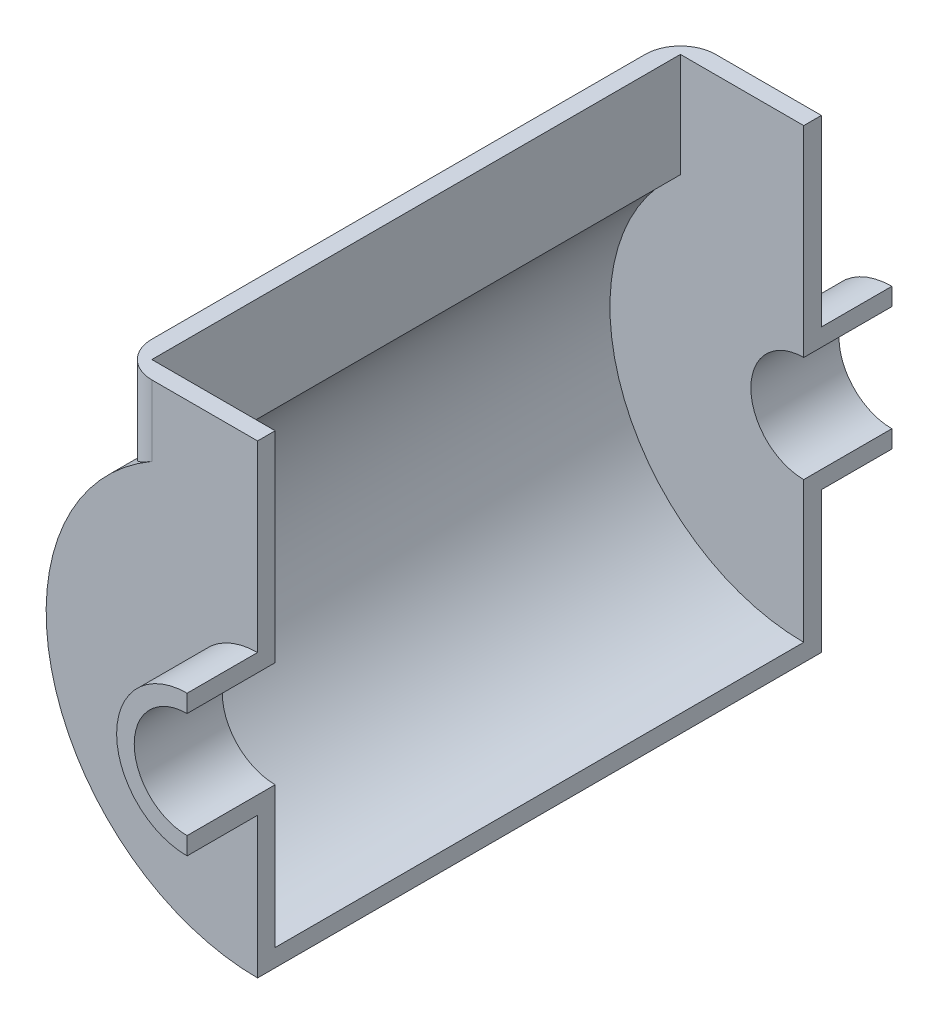
ISO-10303-21;
HEADER;
FILE_DESCRIPTION(('STEP AP214'),'2;1');
FILE_NAME('part.step','',(''),(''),'','','');
FILE_SCHEMA(('AUTOMOTIVE_DESIGN { 1 0 10303 214 1 1 1 1 }'));
ENDSEC;
DATA;
#1=APPLICATION_CONTEXT('core data for automotive mechanical design processes');
#2=APPLICATION_PROTOCOL_DEFINITION('international standard','automotive_design',2000,#1);
#3=PRODUCT_CONTEXT('',#1,'mechanical');
#4=PRODUCT('Part','Part','',(#3));
#5=PRODUCT_RELATED_PRODUCT_CATEGORY('part','',(#4));
#6=PRODUCT_DEFINITION_FORMATION('','',#4);
#7=PRODUCT_DEFINITION_CONTEXT('part definition',#1,'design');
#8=PRODUCT_DEFINITION('design','',#6,#7);
#9=PRODUCT_DEFINITION_SHAPE('','',#8);
#10=(LENGTH_UNIT() NAMED_UNIT(*) SI_UNIT(.MILLI.,.METRE.));
#11=(NAMED_UNIT(*) PLANE_ANGLE_UNIT() SI_UNIT($,.RADIAN.));
#12=(NAMED_UNIT(*) SI_UNIT($,.STERADIAN.) SOLID_ANGLE_UNIT());
#13=UNCERTAINTY_MEASURE_WITH_UNIT(LENGTH_MEASURE(1.E-05),#10,'distance_accuracy_value','');
#14=(GEOMETRIC_REPRESENTATION_CONTEXT(3) GLOBAL_UNCERTAINTY_ASSIGNED_CONTEXT((#13)) GLOBAL_UNIT_ASSIGNED_CONTEXT((#10,
#11,#12)) REPRESENTATION_CONTEXT('',''));
#15=CARTESIAN_POINT('',(0.,0.,0.));
#16=DIRECTION('',(0.,0.,1.));
#17=DIRECTION('',(1.,0.,0.));
#18=AXIS2_PLACEMENT_3D('',#15,#16,#17);
#19=CARTESIAN_POINT('',(0.,0.,25.));
#20=DIRECTION('',(0.,0.,-1.));
#21=DIRECTION('',(-1.,0.,0.));
#22=AXIS2_PLACEMENT_3D('',#19,#20,#21);
#23=CYLINDRICAL_SURFACE('',#22,15.);
#24=CARTESIAN_POINT('',(0.,0.,0.));
#25=DIRECTION('',(0.,0.,-1.));
#26=DIRECTION('',(-1.,0.,0.));
#27=AXIS2_PLACEMENT_3D('',#24,#25,#26);
#28=CIRCLE('',#27,15.);
#29=CARTESIAN_POINT('',(0.,-15.,0.));
#30=VERTEX_POINT('',#29);
#31=CARTESIAN_POINT('',(0.,15.,0.));
#32=VERTEX_POINT('',#31);
#33=EDGE_CURVE('E267',#30,#32,#28,.T.);
#34=ORIENTED_EDGE('',*,*,#33,.T.);
#35=DIRECTION('',(0.,0.,-1.));
#36=VECTOR('',#35,1.);
#37=CARTESIAN_POINT('',(0.,15.,25.));
#38=LINE('',#37,#36);
#39=CARTESIAN_POINT('',(0.,15.,25.));
#40=VERTEX_POINT('',#39);
#41=EDGE_CURVE('E291',#40,#32,#38,.T.);
#42=ORIENTED_EDGE('',*,*,#41,.F.);
#43=CARTESIAN_POINT('',(0.,0.,25.));
#44=DIRECTION('',(0.,0.,-1.));
#45=DIRECTION('',(-1.,0.,0.));
#46=AXIS2_PLACEMENT_3D('',#43,#44,#45);
#47=CIRCLE('',#46,15.);
#48=CARTESIAN_POINT('',(0.,-15.,25.));
#49=VERTEX_POINT('',#48);
#50=EDGE_CURVE('E268',#49,#40,#47,.T.);
#51=ORIENTED_EDGE('',*,*,#50,.F.);
#52=DIRECTION('',(0.,0.,-1.));
#53=VECTOR('',#52,1.);
#54=CARTESIAN_POINT('',(0.,-15.,25.));
#55=LINE('',#54,#53);
#56=EDGE_CURVE('E278',#49,#30,#55,.T.);
#57=ORIENTED_EDGE('',*,*,#56,.T.);
#58=EDGE_LOOP('',(#34,#42,#51,#57));
#59=FACE_BOUND('',#58,.T.);
#60=ADVANCED_FACE('F33',(#59),#23,.F.);
#61=CARTESIAN_POINT('',(0.,20.,25.));
#62=DIRECTION('',(-1.,0.,0.));
#63=DIRECTION('',(0.,-1.,0.));
#64=AXIS2_PLACEMENT_3D('',#61,#62,#63);
#65=PLANE('',#64);
#66=DIRECTION('',(0.,1.,0.));
#67=VECTOR('',#66,1.);
#68=CARTESIAN_POINT('',(0.,20.,0.));
#69=LINE('',#68,#67);
#70=CARTESIAN_POINT('',(0.,72.,0.));
#71=VERTEX_POINT('',#70);
#72=EDGE_CURVE('E281',#32,#71,#69,.T.);
#73=ORIENTED_EDGE('',*,*,#72,.T.);
#74=DIRECTION('',(0.,0.,-1.));
#75=VECTOR('',#74,1.);
#76=CARTESIAN_POINT('',(0.,72.,5.));
#77=LINE('',#76,#75);
#78=CARTESIAN_POINT('',(0.,72.,5.));
#79=VERTEX_POINT('',#78);
#80=EDGE_CURVE('E264',#79,#71,#77,.T.);
#81=ORIENTED_EDGE('',*,*,#80,.F.);
#82=DIRECTION('',(0.,1.,0.));
#83=VECTOR('',#82,1.);
#84=CARTESIAN_POINT('',(0.,72.,5.));
#85=LINE('',#84,#83);
#86=CARTESIAN_POINT('',(0.,20.,5.));
#87=VERTEX_POINT('',#86);
#88=EDGE_CURVE('E244',#87,#79,#85,.T.);
#89=ORIENTED_EDGE('',*,*,#88,.F.);
#90=DIRECTION('',(0.,0.,-1.));
#91=VECTOR('',#90,1.);
#92=CARTESIAN_POINT('',(0.,20.,25.));
#93=LINE('',#92,#91);
#94=CARTESIAN_POINT('',(0.,20.,25.));
#95=VERTEX_POINT('',#94);
#96=EDGE_CURVE('E289',#95,#87,#93,.T.);
#97=ORIENTED_EDGE('',*,*,#96,.F.);
#98=DIRECTION('',(0.,1.,0.));
#99=VECTOR('',#98,1.);
#100=CARTESIAN_POINT('',(0.,20.,25.));
#101=LINE('',#100,#99);
#102=EDGE_CURVE('E271',#40,#95,#101,.T.);
#103=ORIENTED_EDGE('',*,*,#102,.F.);
#104=ORIENTED_EDGE('',*,*,#41,.T.);
#105=EDGE_LOOP('',(#73,#81,#89,#97,#103,#104));
#106=FACE_BOUND('',#105,.T.);
#107=ADVANCED_FACE('F321',(#106),#65,.F.);
#108=CARTESIAN_POINT('',(0.,0.,25.));
#109=DIRECTION('',(0.,0.,-1.));
#110=DIRECTION('',(-1.,0.,0.));
#111=AXIS2_PLACEMENT_3D('',#108,#109,#110);
#112=CYLINDRICAL_SURFACE('',#111,20.);
#113=ORIENTED_EDGE('',*,*,#96,.T.);
#114=CARTESIAN_POINT('',(0.,0.,5.));
#115=DIRECTION('',(0.,0.,-1.));
#116=DIRECTION('',(1.,0.,0.));
#117=AXIS2_PLACEMENT_3D('',#114,#115,#116);
#118=CIRCLE('',#117,20.);
#119=CARTESIAN_POINT('',(0.,-20.,5.));
#120=VERTEX_POINT('',#119);
#121=EDGE_CURVE('E241',#120,#87,#118,.T.);
#122=ORIENTED_EDGE('',*,*,#121,.F.);
#123=DIRECTION('',(0.,0.,-1.));
#124=VECTOR('',#123,1.);
#125=CARTESIAN_POINT('',(0.,-20.,25.));
#126=LINE('',#125,#124);
#127=CARTESIAN_POINT('',(0.,-20.,25.));
#128=VERTEX_POINT('',#127);
#129=EDGE_CURVE('E286',#128,#120,#126,.T.);
#130=ORIENTED_EDGE('',*,*,#129,.F.);
#131=CARTESIAN_POINT('',(0.,0.,25.));
#132=DIRECTION('',(0.,0.,1.));
#133=DIRECTION('',(-1.,0.,0.));
#134=AXIS2_PLACEMENT_3D('',#131,#132,#133);
#135=CIRCLE('',#134,20.);
#136=EDGE_CURVE('E274',#95,#128,#135,.T.);
#137=ORIENTED_EDGE('',*,*,#136,.F.);
#138=EDGE_LOOP('',(#113,#122,#130,#137));
#139=FACE_BOUND('',#138,.T.);
#140=ADVANCED_FACE('F325',(#139),#112,.T.);
#141=CARTESIAN_POINT('',(0.,-15.,25.));
#142=DIRECTION('',(-1.,0.,0.));
#143=DIRECTION('',(0.,-1.,0.));
#144=AXIS2_PLACEMENT_3D('',#141,#142,#143);
#145=PLANE('',#144);
#146=DIRECTION('',(0.,0.,-1.));
#147=VECTOR('',#146,1.);
#148=CARTESIAN_POINT('',(0.,-60.,5.));
#149=LINE('',#148,#147);
#150=CARTESIAN_POINT('',(0.,-60.,5.));
#151=VERTEX_POINT('',#150);
#152=CARTESIAN_POINT('',(0.,-60.,-155.));
#153=VERTEX_POINT('',#152);
#154=EDGE_CURVE('E254',#151,#153,#149,.T.);
#155=ORIENTED_EDGE('',*,*,#154,.T.);
#156=DIRECTION('',(0.,1.,0.));
#157=VECTOR('',#156,1.);
#158=CARTESIAN_POINT('',(0.,-20.,-155.));
#159=LINE('',#158,#157);
#160=CARTESIAN_POINT('',(0.,-20.,-155.));
#161=VERTEX_POINT('',#160);
#162=EDGE_CURVE('E180',#153,#161,#159,.T.);
#163=ORIENTED_EDGE('',*,*,#162,.T.);
#164=DIRECTION('',(0.,0.,1.));
#165=VECTOR('',#164,1.);
#166=CARTESIAN_POINT('',(0.,-20.,-175.));
#167=LINE('',#166,#165);
#168=CARTESIAN_POINT('',(0.,-20.,-175.));
#169=VERTEX_POINT('',#168);
#170=EDGE_CURVE('E212',#169,#161,#167,.T.);
#171=ORIENTED_EDGE('',*,*,#170,.F.);
#172=DIRECTION('',(0.,1.,0.));
#173=VECTOR('',#172,1.);
#174=CARTESIAN_POINT('',(0.,-15.,-175.));
#175=LINE('',#174,#173);
#176=CARTESIAN_POINT('',(0.,-15.,-175.));
#177=VERTEX_POINT('',#176);
#178=EDGE_CURVE('E202',#169,#177,#175,.T.);
#179=ORIENTED_EDGE('',*,*,#178,.T.);
#180=DIRECTION('',(0.,0.,1.));
#181=VECTOR('',#180,1.);
#182=CARTESIAN_POINT('',(0.,-15.,-175.));
#183=LINE('',#182,#181);
#184=CARTESIAN_POINT('',(0.,-15.,-150.));
#185=VERTEX_POINT('',#184);
#186=EDGE_CURVE('E204',#177,#185,#183,.T.);
#187=ORIENTED_EDGE('',*,*,#186,.T.);
#188=DIRECTION('',(0.,1.,0.));
#189=VECTOR('',#188,1.);
#190=CARTESIAN_POINT('',(0.,-15.,-150.));
#191=LINE('',#190,#189);
#192=CARTESIAN_POINT('',(0.,-55.,-150.));
#193=VERTEX_POINT('',#192);
#194=EDGE_CURVE('E197',#193,#185,#191,.T.);
#195=ORIENTED_EDGE('',*,*,#194,.F.);
#196=DIRECTION('',(0.,0.,1.));
#197=VECTOR('',#196,1.);
#198=CARTESIAN_POINT('',(0.,-55.,-175.002));
#199=LINE('',#198,#197);
#200=CARTESIAN_POINT('',(0.,-55.,0.));
#201=VERTEX_POINT('',#200);
#202=EDGE_CURVE('E225',#193,#201,#199,.T.);
#203=ORIENTED_EDGE('',*,*,#202,.T.);
#204=DIRECTION('',(0.,1.,0.));
#205=VECTOR('',#204,1.);
#206=CARTESIAN_POINT('',(0.,-15.,0.));
#207=LINE('',#206,#205);
#208=EDGE_CURVE('E272',#201,#30,#207,.T.);
#209=ORIENTED_EDGE('',*,*,#208,.T.);
#210=ORIENTED_EDGE('',*,*,#56,.F.);
#211=DIRECTION('',(0.,1.,0.));
#212=VECTOR('',#211,1.);
#213=CARTESIAN_POINT('',(0.,-15.,25.));
#214=LINE('',#213,#212);
#215=EDGE_CURVE('E276',#128,#49,#214,.T.);
#216=ORIENTED_EDGE('',*,*,#215,.F.);
#217=ORIENTED_EDGE('',*,*,#129,.T.);
#218=DIRECTION('',(0.,1.,0.));
#219=VECTOR('',#218,1.);
#220=CARTESIAN_POINT('',(0.,-20.,5.));
#221=LINE('',#220,#219);
#222=EDGE_CURVE('E251',#151,#120,#221,.T.);
#223=ORIENTED_EDGE('',*,*,#222,.F.);
#224=EDGE_LOOP('',(#155,#163,#171,#179,#187,#195,#203,#209,#210,#216,#217,#223));
#225=FACE_BOUND('',#224,.T.);
#226=ADVANCED_FACE('F329',(#225),#145,.F.);
#227=CARTESIAN_POINT('',(0.,0.,25.));
#228=DIRECTION('',(0.,0.,-1.));
#229=DIRECTION('',(-1.,0.,0.));
#230=AXIS2_PLACEMENT_3D('',#227,#228,#229);
#231=PLANE('',#230);
#232=ORIENTED_EDGE('',*,*,#50,.T.);
#233=ORIENTED_EDGE('',*,*,#102,.T.);
#234=ORIENTED_EDGE('',*,*,#136,.T.);
#235=ORIENTED_EDGE('',*,*,#215,.T.);
#236=EDGE_LOOP('',(#232,#233,#234,#235));
#237=FACE_BOUND('',#236,.T.);
#238=ADVANCED_FACE('F333',(#237),#231,.F.);
#239=CARTESIAN_POINT('',(0.,0.,0.));
#240=DIRECTION('',(0.,0.,-1.));
#241=DIRECTION('',(-1.,0.,0.));
#242=AXIS2_PLACEMENT_3D('',#239,#240,#241);
#243=PLANE('',#242);
#244=CARTESIAN_POINT('',(0.,0.,0.));
#245=DIRECTION('',(0.,0.,1.));
#246=DIRECTION('',(1.,0.,0.));
#247=AXIS2_PLACEMENT_3D('',#244,#245,#246);
#248=CIRCLE('',#247,55.);
#249=CARTESIAN_POINT('',(-35.,42.4264068711928,0.));
#250=VERTEX_POINT('',#249);
#251=EDGE_CURVE('E226',#250,#201,#248,.T.);
#252=ORIENTED_EDGE('',*,*,#251,.F.);
#253=DIRECTION('',(0.,-1.,0.));
#254=VECTOR('',#253,1.);
#255=CARTESIAN_POINT('',(-35.,72.,0.));
#256=LINE('',#255,#254);
#257=CARTESIAN_POINT('',(-35.,72.,0.));
#258=VERTEX_POINT('',#257);
#259=EDGE_CURVE('E230',#258,#250,#256,.T.);
#260=ORIENTED_EDGE('',*,*,#259,.F.);
#261=DIRECTION('',(-1.,0.,0.));
#262=VECTOR('',#261,1.);
#263=CARTESIAN_POINT('',(-40.,72.,0.));
#264=LINE('',#263,#262);
#265=EDGE_CURVE('E229',#71,#258,#264,.T.);
#266=ORIENTED_EDGE('',*,*,#265,.F.);
#267=ORIENTED_EDGE('',*,*,#72,.F.);
#268=ORIENTED_EDGE('',*,*,#33,.F.);
#269=ORIENTED_EDGE('',*,*,#208,.F.);
#270=EDGE_LOOP('',(#252,#260,#266,#267,#268,#269));
#271=FACE_BOUND('',#270,.T.);
#272=ADVANCED_FACE('F335',(#271),#243,.T.);
#273=CARTESIAN_POINT('',(-40.,72.,5.));
#274=DIRECTION('',(0.,-1.,0.));
#275=DIRECTION('',(0.,0.,-1.));
#276=AXIS2_PLACEMENT_3D('',#273,#274,#275);
#277=PLANE('',#276);
#278=DIRECTION('',(0.,0.,-1.));
#279=VECTOR('',#278,1.);
#280=CARTESIAN_POINT('',(-40.,72.,5.));
#281=LINE('',#280,#279);
#282=CARTESIAN_POINT('',(-40.,72.,-5.));
#283=VERTEX_POINT('',#282);
#284=CARTESIAN_POINT('',(-40.,72.,-145.));
#285=VERTEX_POINT('',#284);
#286=EDGE_CURVE('E261',#283,#285,#281,.T.);
#287=ORIENTED_EDGE('',*,*,#286,.F.);
#288=CARTESIAN_POINT('',(-30.,72.,-5.));
#289=DIRECTION('',(0.,-1.,0.));
#290=DIRECTION('',(0.,0.,-1.));
#291=AXIS2_PLACEMENT_3D('',#288,#289,#290);
#292=CIRCLE('',#291,10.);
#293=CARTESIAN_POINT('',(-30.,72.,5.));
#294=VERTEX_POINT('',#293);
#295=EDGE_CURVE('E304',#283,#294,#292,.F.);
#296=ORIENTED_EDGE('',*,*,#295,.T.);
#297=DIRECTION('',(-1.,0.,0.));
#298=VECTOR('',#297,1.);
#299=CARTESIAN_POINT('',(-40.,72.,5.));
#300=LINE('',#299,#298);
#301=EDGE_CURVE('E246',#79,#294,#300,.T.);
#302=ORIENTED_EDGE('',*,*,#301,.F.);
#303=ORIENTED_EDGE('',*,*,#80,.T.);
#304=ORIENTED_EDGE('',*,*,#265,.T.);
#305=DIRECTION('',(0.,0.,1.));
#306=VECTOR('',#305,1.);
#307=CARTESIAN_POINT('',(-35.,72.,-175.002));
#308=LINE('',#307,#306);
#309=CARTESIAN_POINT('',(-35.,72.,-150.));
#310=VERTEX_POINT('',#309);
#311=EDGE_CURVE('E233',#310,#258,#308,.T.);
#312=ORIENTED_EDGE('',*,*,#311,.F.);
#313=DIRECTION('',(-1.,0.,0.));
#314=VECTOR('',#313,1.);
#315=CARTESIAN_POINT('',(-40.,72.,-150.));
#316=LINE('',#315,#314);
#317=CARTESIAN_POINT('',(0.,72.,-150.));
#318=VERTEX_POINT('',#317);
#319=EDGE_CURVE('E176',#318,#310,#316,.T.);
#320=ORIENTED_EDGE('',*,*,#319,.F.);
#321=DIRECTION('',(0.,0.,1.));
#322=VECTOR('',#321,1.);
#323=CARTESIAN_POINT('',(0.,72.,-155.));
#324=LINE('',#323,#322);
#325=CARTESIAN_POINT('',(0.,72.,-155.));
#326=VERTEX_POINT('',#325);
#327=EDGE_CURVE('E172',#326,#318,#324,.T.);
#328=ORIENTED_EDGE('',*,*,#327,.F.);
#329=DIRECTION('',(-1.,0.,0.));
#330=VECTOR('',#329,1.);
#331=CARTESIAN_POINT('',(-40.,72.,-155.));
#332=LINE('',#331,#330);
#333=CARTESIAN_POINT('',(-30.,72.,-155.));
#334=VERTEX_POINT('',#333);
#335=EDGE_CURVE('E161',#326,#334,#332,.T.);
#336=ORIENTED_EDGE('',*,*,#335,.T.);
#337=CARTESIAN_POINT('',(-30.,72.,-145.));
#338=DIRECTION('',(0.,-1.,0.));
#339=DIRECTION('',(0.,0.,-1.));
#340=AXIS2_PLACEMENT_3D('',#337,#338,#339);
#341=CIRCLE('',#340,10.);
#342=EDGE_CURVE('E302',#334,#285,#341,.F.);
#343=ORIENTED_EDGE('',*,*,#342,.T.);
#344=EDGE_LOOP('',(#287,#296,#302,#303,#304,#312,#320,#328,#336,#343));
#345=FACE_BOUND('',#344,.T.);
#346=ADVANCED_FACE('F174',(#345),#277,.F.);
#347=CARTESIAN_POINT('',(-40.,44.7213595499958,5.));
#348=DIRECTION('',(1.,0.,0.));
#349=DIRECTION('',(0.,0.,-1.));
#350=AXIS2_PLACEMENT_3D('',#347,#348,#349);
#351=PLANE('',#350);
#352=DIRECTION('',(0.,0.,-1.));
#353=VECTOR('',#352,1.);
#354=CARTESIAN_POINT('',(-40.,44.7213595499958,5.));
#355=LINE('',#354,#353);
#356=CARTESIAN_POINT('',(-40.,44.7213595499958,-5.));
#357=VERTEX_POINT('',#356);
#358=CARTESIAN_POINT('',(-40.,44.7213595499958,-145.));
#359=VERTEX_POINT('',#358);
#360=EDGE_CURVE('E258',#357,#359,#355,.T.);
#361=ORIENTED_EDGE('',*,*,#360,.F.);
#362=DIRECTION('',(0.,-1.,0.));
#363=VECTOR('',#362,1.);
#364=CARTESIAN_POINT('',(-40.,72.,-5.));
#365=LINE('',#364,#363);
#366=EDGE_CURVE('E300',#357,#283,#365,.F.);
#367=ORIENTED_EDGE('',*,*,#366,.T.);
#368=ORIENTED_EDGE('',*,*,#286,.T.);
#369=DIRECTION('',(0.,-1.,0.));
#370=VECTOR('',#369,1.);
#371=CARTESIAN_POINT('',(-40.,44.7213595499958,-145.));
#372=LINE('',#371,#370);
#373=EDGE_CURVE('E297',#285,#359,#372,.T.);
#374=ORIENTED_EDGE('',*,*,#373,.T.);
#375=EDGE_LOOP('',(#361,#367,#368,#374));
#376=FACE_BOUND('',#375,.T.);
#377=ADVANCED_FACE('F343',(#376),#351,.F.);
#378=CARTESIAN_POINT('',(0.,0.,5.));
#379=DIRECTION('',(0.,0.,-1.));
#380=DIRECTION('',(-1.,0.,0.));
#381=AXIS2_PLACEMENT_3D('',#378,#379,#380);
#382=CYLINDRICAL_SURFACE('',#381,60.);
#383=CARTESIAN_POINT('',(0.,0.,5.));
#384=DIRECTION('',(0.,0.,1.));
#385=DIRECTION('',(-1.,0.,0.));
#386=AXIS2_PLACEMENT_3D('',#383,#384,#385);
#387=CIRCLE('',#386,60.);
#388=CARTESIAN_POINT('',(-30.,51.9615242270663,5.));
#389=VERTEX_POINT('',#388);
#390=EDGE_CURVE('E249',#389,#151,#387,.T.);
#391=ORIENTED_EDGE('',*,*,#390,.F.);
#392=CARTESIAN_POINT('',(-30.,51.9615242270663,5.));
#393=CARTESIAN_POINT('',(-30.1846403402756,51.8549243575684,4.99999694467445));
#394=CARTESIAN_POINT('',(-30.3686755821332,51.7473565843307,4.99488587812623));
#395=CARTESIAN_POINT('',(-30.7351668388072,51.5305231450817,4.97462918627216));
#396=CARTESIAN_POINT('',(-30.9176229894396,51.4212576273974,4.95948443281986));
#397=CARTESIAN_POINT('',(-31.4619253243051,51.0913595980358,4.89929167200636));
#398=CARTESIAN_POINT('',(-31.8209014856786,50.868512343648,4.83948477245505));
#399=CARTESIAN_POINT('',(-32.5288887310146,50.418725257113,4.68176841927459));
#400=CARTESIAN_POINT('',(-32.8778736192083,50.1917768316845,4.5837671788936));
#401=CARTESIAN_POINT('',(-33.562476910193,49.7365966241752,4.35090696893926));
#402=CARTESIAN_POINT('',(-33.8980954977704,49.5083648598862,4.21604850911225));
#403=CARTESIAN_POINT('',(-34.5207296024579,49.0759439346811,3.92574534472068));
#404=CARTESIAN_POINT('',(-34.8092512536601,48.8716304811259,3.77370267176126));
#405=CARTESIAN_POINT('',(-35.3716903107987,48.4661085573826,3.44107089228342));
#406=CARTESIAN_POINT('',(-35.6456079007732,48.2649000480893,3.26048214561176));
#407=CARTESIAN_POINT('',(-36.1765727574088,47.8682074936152,2.87135112309205));
#408=CARTESIAN_POINT('',(-36.4336405194033,47.6727166603459,2.66284378257167));
#409=CARTESIAN_POINT('',(-36.9290721152615,47.289972828363,2.21794621899144));
#410=CARTESIAN_POINT('',(-37.167441451851,47.1027174132443,1.98156425075618));
#411=CARTESIAN_POINT('',(-37.565018182153,46.785859634165,1.54478146403292));
#412=CARTESIAN_POINT('',(-37.7289458526818,46.6537017113221,1.35050833176437));
#413=CARTESIAN_POINT('',(-38.0437650386959,46.397339573439,0.946710505836691));
#414=CARTESIAN_POINT('',(-38.1946575996422,46.2731347207424,0.737187037795451));
#415=CARTESIAN_POINT('',(-38.4818360085844,46.0345861261904,0.303399948510743));
#416=CARTESIAN_POINT('',(-38.618136880254,45.9202322658759,0.0791518792914404));
#417=CARTESIAN_POINT('',(-38.8746918035924,45.7032445431668,-0.383743447816962));
#418=CARTESIAN_POINT('',(-38.9949492411763,45.6006082084878,-0.62238765196006));
#419=CARTESIAN_POINT('',(-39.1965662504922,45.4273417305266,-1.06669402634214));
#420=CARTESIAN_POINT('',(-39.2809795718102,45.3543309967536,-1.27004581930021));
#421=CARTESIAN_POINT('',(-39.437114382813,45.2186323209963,-1.68488791321454));
#422=CARTESIAN_POINT('',(-39.508838494378,45.1559422467147,-1.89637652189831));
#423=CARTESIAN_POINT('',(-39.6385128100447,45.0421551914612,-2.32617263610176));
#424=CARTESIAN_POINT('',(-39.6964869139818,44.9910381018204,-2.54446755239788));
#425=CARTESIAN_POINT('',(-39.7978943535571,44.9013606141582,-2.98685266600599));
#426=CARTESIAN_POINT('',(-39.8413328734582,44.8627957393971,-3.21094076633609));
#427=CARTESIAN_POINT('',(-39.9177189665931,44.7948514731765,-3.6937744282411));
#428=CARTESIAN_POINT('',(-39.9484884415043,44.7673886419263,-3.95314914513774));
#429=CARTESIAN_POINT('',(-39.9793476433001,44.7398248250479,-4.34440444684136));
#430=CARTESIAN_POINT('',(-39.987084921451,44.7329085695169,-4.47527578752073));
#431=CARTESIAN_POINT('',(-39.9974129661721,44.7236736235071,-4.73742237599204));
#432=CARTESIAN_POINT('',(-40.0000021863485,44.7213563144782,-4.86869773328782));
#433=CARTESIAN_POINT('',(-40.,44.7213595499958,-5.));
#434=B_SPLINE_CURVE_WITH_KNOTS('',3,(#392,#393,#394,#395,#396,#397,#398,#399,#400,#401,#402,
#403,#404,#405,#406,#407,#408,#409,#410,#411,#412,#413,#414,#415,#416,#417,#418,#419,#420,#421,
#422,#423,#424,#425,#426,#427,#428,#429,#430,#431,#432,#433),.UNSPECIFIED.,.F.,.F.,(4,2,2,2,2,2,
2,2,2,2,2,2,2,2,2,2,2,2,2,2,4),(0.,0.639469988122809,1.27888441829631,2.5570367234409,
3.83827975129429,5.11950506007103,6.27274736359202,7.42597513070352,8.5777730871098,
9.72923080131073,10.5879927572485,11.4466857734357,12.3044859953459,13.1621048939207,
13.8573439066469,14.5524390989254,15.2463170957639,15.9399473495783,16.7262834977137,
17.1199731890566,17.5137811205932),.UNSPECIFIED.);
#435=EDGE_CURVE('E47',#389,#357,#434,.T.);
#436=ORIENTED_EDGE('',*,*,#435,.T.);
#437=ORIENTED_EDGE('',*,*,#360,.T.);
#438=CARTESIAN_POINT('',(-40.,44.7213595499958,-145.));
#439=CARTESIAN_POINT('',(-40.0000015812733,44.7213573011344,-145.117663401002));
#440=CARTESIAN_POINT('',(-39.9979227141808,44.7232176305845,-145.235308654986));
#441=CARTESIAN_POINT('',(-39.9896253110866,44.7306372942272,-145.47032860166));
#442=CARTESIAN_POINT('',(-39.9834070494192,44.7361963832882,-145.587703311763));
#443=CARTESIAN_POINT('',(-39.9585923280535,44.7583670958171,-145.938842746759));
#444=CARTESIAN_POINT('',(-39.9338358355778,44.7804722797486,-146.17187580546));
#445=CARTESIAN_POINT('',(-39.8686644525486,44.8385042167555,-146.631869132649));
#446=CARTESIAN_POINT('',(-39.8283855148164,44.8743109465834,-146.858864322374));
#447=CARTESIAN_POINT('',(-39.7328892662281,44.9588875680342,-147.307252447912));
#448=CARTESIAN_POINT('',(-39.6776696039361,45.0076595001554,-147.528644495876));
#449=CARTESIAN_POINT('',(-39.5534118644793,45.116897250534,-147.963668864973));
#450=CARTESIAN_POINT('',(-39.4844211995899,45.1773229225701,-148.177324917885));
#451=CARTESIAN_POINT('',(-39.3334605195833,45.3088170177995,-148.596693654264));
#452=CARTESIAN_POINT('',(-39.2514857085459,45.3798893730022,-148.802403367552));
#453=CARTESIAN_POINT('',(-39.0753863002098,45.5316122169458,-149.205452937737));
#454=CARTESIAN_POINT('',(-38.9812363061758,45.6122826978885,-149.402774120032));
#455=CARTESIAN_POINT('',(-38.7818943790383,45.7818938454653,-149.788046749896));
#456=CARTESIAN_POINT('',(-38.6767013504078,45.8708353325264,-149.975997265112));
#457=CARTESIAN_POINT('',(-38.4135728743112,46.0916172160901,-150.412907048327));
#458=CARTESIAN_POINT('',(-38.2509572804995,46.2267600621542,-150.657396797582));
#459=CARTESIAN_POINT('',(-37.908447036405,46.5080507377658,-151.127069763362));
#460=CARTESIAN_POINT('',(-37.7285517130429,46.6541989959475,-151.352252227183));
#461=CARTESIAN_POINT('',(-37.3531054007839,46.9553345195759,-151.783333742699));
#462=CARTESIAN_POINT('',(-37.1575367002328,47.1103317262239,-151.989210391397));
#463=CARTESIAN_POINT('',(-36.7525951751676,47.4269223387039,-152.381183869274));
#464=CARTESIAN_POINT('',(-36.5432234671629,47.5885152106185,-152.567282295118));
#465=CARTESIAN_POINT('',(-35.889352420626,48.0859277319981,-153.101595181572));
#466=CARTESIAN_POINT('',(-35.4251261289153,48.429498559668,-153.418982987117));
#467=CARTESIAN_POINT('',(-34.4553726874119,49.1241578823887,-153.96997164966));
#468=CARTESIAN_POINT('',(-33.9498747171002,49.4752409388269,-154.203631084267));
#469=CARTESIAN_POINT('',(-33.1568278633414,50.0073212539566,-154.493045687864));
#470=CARTESIAN_POINT('',(-32.8810021018504,50.1891501210001,-154.580381966568));
#471=CARTESIAN_POINT('',(-32.3217375725054,50.5511235483305,-154.731052467128));
#472=CARTESIAN_POINT('',(-32.0382991780871,50.7312681906542,-154.794387864047));
#473=CARTESIAN_POINT('',(-31.4650006560554,51.0888227050653,-154.896393997853));
#474=CARTESIAN_POINT('',(-31.1751356203563,51.2662302982853,-154.935045161166));
#475=CARTESIAN_POINT('',(-30.5906934832528,51.6171131325133,-154.98684851371));
#476=CARTESIAN_POINT('',(-30.2961152167169,51.7905873747387,-154.999994296549));
#477=CARTESIAN_POINT('',(-30.,51.9615242270663,-155.));
#478=B_SPLINE_CURVE_WITH_KNOTS('',3,(#438,#439,#440,#441,#442,#443,#444,#445,#446,#447,#448,
#449,#450,#451,#452,#453,#454,#455,#456,#457,#458,#459,#460,#461,#462,#463,#464,#465,#466,#467,
#468,#469,#470,#471,#472,#473,#474,#475,#476,#477),.UNSPECIFIED.,.F.,.F.,(4,2,2,2,2,2,2,2,2,2,2,
2,2,2,2,2,2,2,2,4),(0.,0.352921378883199,0.705819370583172,1.41085932128632,2.10985961734754,
2.80896998914978,3.50571366437716,4.20271529673452,4.9011950223396,5.59974410640155,
6.56805788163329,7.53640938987801,8.50587104319844,9.47525437387456,11.4447404103531,
13.4128458625583,14.4372042618812,15.4615125030147,16.4866319729198,17.5120088970542),.UNSPECIFIED.);
#479=CARTESIAN_POINT('',(-30.,51.9615242270663,-155.));
#480=VERTEX_POINT('',#479);
#481=EDGE_CURVE('E11',#359,#480,#478,.T.);
#482=ORIENTED_EDGE('',*,*,#481,.T.);
#483=CARTESIAN_POINT('',(0.,0.,-155.));
#484=DIRECTION('',(0.,0.,1.));
#485=DIRECTION('',(-1.,0.,0.));
#486=AXIS2_PLACEMENT_3D('',#483,#484,#485);
#487=CIRCLE('',#486,60.);
#488=EDGE_CURVE('E54',#480,#153,#487,.T.);
#489=ORIENTED_EDGE('',*,*,#488,.T.);
#490=ORIENTED_EDGE('',*,*,#154,.F.);
#491=EDGE_LOOP('',(#391,#436,#437,#482,#489,#490));
#492=FACE_BOUND('',#491,.T.);
#493=ADVANCED_FACE('F310',(#492),#382,.T.);
#494=CARTESIAN_POINT('',(0.,0.,5.));
#495=DIRECTION('',(0.,0.,1.));
#496=DIRECTION('',(1.,0.,0.));
#497=AXIS2_PLACEMENT_3D('',#494,#495,#496);
#498=PLANE('',#497);
#499=ORIENTED_EDGE('',*,*,#301,.T.);
#500=DIRECTION('',(0.,-1.,0.));
#501=VECTOR('',#500,1.);
#502=CARTESIAN_POINT('',(-30.,44.7213595499958,5.));
#503=LINE('',#502,#501);
#504=EDGE_CURVE('E294',#294,#389,#503,.T.);
#505=ORIENTED_EDGE('',*,*,#504,.T.);
#506=ORIENTED_EDGE('',*,*,#390,.T.);
#507=ORIENTED_EDGE('',*,*,#222,.T.);
#508=ORIENTED_EDGE('',*,*,#121,.T.);
#509=ORIENTED_EDGE('',*,*,#88,.T.);
#510=EDGE_LOOP('',(#499,#505,#506,#507,#508,#509));
#511=FACE_BOUND('',#510,.T.);
#512=ADVANCED_FACE('F349',(#511),#498,.T.);
#513=CARTESIAN_POINT('',(0.,0.,-175.002));
#514=DIRECTION('',(0.,0.,1.));
#515=DIRECTION('',(1.,0.,0.));
#516=AXIS2_PLACEMENT_3D('',#513,#514,#515);
#517=CYLINDRICAL_SURFACE('',#516,55.);
#518=ORIENTED_EDGE('',*,*,#202,.F.);
#519=CARTESIAN_POINT('',(0.,0.,-150.));
#520=DIRECTION('',(0.,0.,1.));
#521=DIRECTION('',(1.,0.,0.));
#522=AXIS2_PLACEMENT_3D('',#519,#520,#521);
#523=CIRCLE('',#522,55.);
#524=CARTESIAN_POINT('',(-35.,42.4264068711928,-150.));
#525=VERTEX_POINT('',#524);
#526=EDGE_CURVE('E219',#193,#525,#523,.F.);
#527=ORIENTED_EDGE('',*,*,#526,.T.);
#528=DIRECTION('',(0.,0.,1.));
#529=VECTOR('',#528,1.);
#530=CARTESIAN_POINT('',(-35.,42.4264068711928,-175.002));
#531=LINE('',#530,#529);
#532=EDGE_CURVE('E236',#525,#250,#531,.T.);
#533=ORIENTED_EDGE('',*,*,#532,.T.);
#534=ORIENTED_EDGE('',*,*,#251,.T.);
#535=EDGE_LOOP('',(#518,#527,#533,#534));
#536=FACE_BOUND('',#535,.T.);
#537=ADVANCED_FACE('F372',(#536),#517,.F.);
#538=CARTESIAN_POINT('',(-35.,72.,-175.002));
#539=DIRECTION('',(-1.,0.,0.));
#540=DIRECTION('',(0.,-1.,0.));
#541=AXIS2_PLACEMENT_3D('',#538,#539,#540);
#542=PLANE('',#541);
#543=ORIENTED_EDGE('',*,*,#532,.F.);
#544=DIRECTION('',(0.,1.,0.));
#545=VECTOR('',#544,1.);
#546=CARTESIAN_POINT('',(-35.,72.,-150.));
#547=LINE('',#546,#545);
#548=EDGE_CURVE('E222',#525,#310,#547,.T.);
#549=ORIENTED_EDGE('',*,*,#548,.T.);
#550=ORIENTED_EDGE('',*,*,#311,.T.);
#551=ORIENTED_EDGE('',*,*,#259,.T.);
#552=EDGE_LOOP('',(#543,#549,#550,#551));
#553=FACE_BOUND('',#552,.T.);
#554=ADVANCED_FACE('F366',(#553),#542,.F.);
#555=CARTESIAN_POINT('',(0.,0.,-150.));
#556=DIRECTION('',(0.,0.,1.));
#557=DIRECTION('',(-1.,0.,0.));
#558=AXIS2_PLACEMENT_3D('',#555,#556,#557);
#559=PLANE('',#558);
#560=ORIENTED_EDGE('',*,*,#548,.F.);
#561=ORIENTED_EDGE('',*,*,#526,.F.);
#562=ORIENTED_EDGE('',*,*,#194,.T.);
#563=CARTESIAN_POINT('',(0.,0.,-150.));
#564=DIRECTION('',(0.,0.,-1.));
#565=DIRECTION('',(-1.,0.,0.));
#566=AXIS2_PLACEMENT_3D('',#563,#564,#565);
#567=CIRCLE('',#566,15.);
#568=CARTESIAN_POINT('',(0.,15.,-150.));
#569=VERTEX_POINT('',#568);
#570=EDGE_CURVE('E179',#185,#569,#567,.T.);
#571=ORIENTED_EDGE('',*,*,#570,.T.);
#572=DIRECTION('',(0.,1.,0.));
#573=VECTOR('',#572,1.);
#574=CARTESIAN_POINT('',(0.,20.,-150.));
#575=LINE('',#574,#573);
#576=EDGE_CURVE('E207',#569,#318,#575,.T.);
#577=ORIENTED_EDGE('',*,*,#576,.T.);
#578=ORIENTED_EDGE('',*,*,#319,.T.);
#579=EDGE_LOOP('',(#560,#561,#562,#571,#577,#578));
#580=FACE_BOUND('',#579,.T.);
#581=ADVANCED_FACE('F368',(#580),#559,.T.);
#582=CARTESIAN_POINT('',(0.,0.,-175.));
#583=DIRECTION('',(0.,0.,1.));
#584=DIRECTION('',(-1.,0.,0.));
#585=AXIS2_PLACEMENT_3D('',#582,#583,#584);
#586=CYLINDRICAL_SURFACE('',#585,15.);
#587=ORIENTED_EDGE('',*,*,#570,.F.);
#588=ORIENTED_EDGE('',*,*,#186,.F.);
#589=CARTESIAN_POINT('',(0.,0.,-175.));
#590=DIRECTION('',(0.,0.,-1.));
#591=DIRECTION('',(-1.,0.,0.));
#592=AXIS2_PLACEMENT_3D('',#589,#590,#591);
#593=CIRCLE('',#592,15.);
#594=CARTESIAN_POINT('',(0.,15.,-175.));
#595=VERTEX_POINT('',#594);
#596=EDGE_CURVE('E193',#177,#595,#593,.T.);
#597=ORIENTED_EDGE('',*,*,#596,.T.);
#598=DIRECTION('',(0.,0.,1.));
#599=VECTOR('',#598,1.);
#600=CARTESIAN_POINT('',(0.,15.,-175.));
#601=LINE('',#600,#599);
#602=EDGE_CURVE('E216',#595,#569,#601,.T.);
#603=ORIENTED_EDGE('',*,*,#602,.T.);
#604=EDGE_LOOP('',(#587,#588,#597,#603));
#605=FACE_BOUND('',#604,.T.);
#606=ADVANCED_FACE('F377',(#605),#586,.F.);
#607=CARTESIAN_POINT('',(0.,20.,-175.));
#608=DIRECTION('',(-1.,0.,0.));
#609=DIRECTION('',(0.,-1.,0.));
#610=AXIS2_PLACEMENT_3D('',#607,#608,#609);
#611=PLANE('',#610);
#612=ORIENTED_EDGE('',*,*,#576,.F.);
#613=ORIENTED_EDGE('',*,*,#602,.F.);
#614=DIRECTION('',(0.,1.,0.));
#615=VECTOR('',#614,1.);
#616=CARTESIAN_POINT('',(0.,20.,-175.));
#617=LINE('',#616,#615);
#618=CARTESIAN_POINT('',(0.,20.,-175.));
#619=VERTEX_POINT('',#618);
#620=EDGE_CURVE('E196',#595,#619,#617,.T.);
#621=ORIENTED_EDGE('',*,*,#620,.T.);
#622=DIRECTION('',(0.,0.,1.));
#623=VECTOR('',#622,1.);
#624=CARTESIAN_POINT('',(0.,20.,-175.));
#625=LINE('',#624,#623);
#626=CARTESIAN_POINT('',(0.,20.,-155.));
#627=VERTEX_POINT('',#626);
#628=EDGE_CURVE('E185',#619,#627,#625,.T.);
#629=ORIENTED_EDGE('',*,*,#628,.T.);
#630=DIRECTION('',(0.,1.,0.));
#631=VECTOR('',#630,1.);
#632=CARTESIAN_POINT('',(0.,72.,-155.));
#633=LINE('',#632,#631);
#634=EDGE_CURVE('E166',#627,#326,#633,.T.);
#635=ORIENTED_EDGE('',*,*,#634,.T.);
#636=ORIENTED_EDGE('',*,*,#327,.T.);
#637=EDGE_LOOP('',(#612,#613,#621,#629,#635,#636));
#638=FACE_BOUND('',#637,.T.);
#639=ADVANCED_FACE('F182',(#638),#611,.F.);
#640=CARTESIAN_POINT('',(0.,0.,-175.));
#641=DIRECTION('',(0.,0.,1.));
#642=DIRECTION('',(-1.,0.,0.));
#643=AXIS2_PLACEMENT_3D('',#640,#641,#642);
#644=CYLINDRICAL_SURFACE('',#643,20.);
#645=ORIENTED_EDGE('',*,*,#628,.F.);
#646=CARTESIAN_POINT('',(0.,0.,-175.));
#647=DIRECTION('',(0.,0.,1.));
#648=DIRECTION('',(-1.,0.,0.));
#649=AXIS2_PLACEMENT_3D('',#646,#647,#648);
#650=CIRCLE('',#649,20.);
#651=EDGE_CURVE('E199',#619,#169,#650,.T.);
#652=ORIENTED_EDGE('',*,*,#651,.T.);
#653=ORIENTED_EDGE('',*,*,#170,.T.);
#654=CARTESIAN_POINT('',(0.,0.,-155.));
#655=DIRECTION('',(0.,0.,-1.));
#656=DIRECTION('',(1.,0.,0.));
#657=AXIS2_PLACEMENT_3D('',#654,#655,#656);
#658=CIRCLE('',#657,20.);
#659=EDGE_CURVE('E186',#161,#627,#658,.T.);
#660=ORIENTED_EDGE('',*,*,#659,.T.);
#661=EDGE_LOOP('',(#645,#652,#653,#660));
#662=FACE_BOUND('',#661,.T.);
#663=ADVANCED_FACE('F384',(#662),#644,.T.);
#664=CARTESIAN_POINT('',(0.,0.,-175.));
#665=DIRECTION('',(0.,0.,1.));
#666=DIRECTION('',(-1.,0.,0.));
#667=AXIS2_PLACEMENT_3D('',#664,#665,#666);
#668=PLANE('',#667);
#669=ORIENTED_EDGE('',*,*,#596,.F.);
#670=ORIENTED_EDGE('',*,*,#178,.F.);
#671=ORIENTED_EDGE('',*,*,#651,.F.);
#672=ORIENTED_EDGE('',*,*,#620,.F.);
#673=EDGE_LOOP('',(#669,#670,#671,#672));
#674=FACE_BOUND('',#673,.T.);
#675=ADVANCED_FACE('F381',(#674),#668,.F.);
#676=CARTESIAN_POINT('',(0.,0.,-155.));
#677=DIRECTION('',(0.,0.,-1.));
#678=DIRECTION('',(1.,0.,0.));
#679=AXIS2_PLACEMENT_3D('',#676,#677,#678);
#680=PLANE('',#679);
#681=ORIENTED_EDGE('',*,*,#488,.F.);
#682=DIRECTION('',(0.,-1.,0.));
#683=VECTOR('',#682,1.);
#684=CARTESIAN_POINT('',(-30.,72.,-155.));
#685=LINE('',#684,#683);
#686=EDGE_CURVE('E58',#480,#334,#685,.F.);
#687=ORIENTED_EDGE('',*,*,#686,.T.);
#688=ORIENTED_EDGE('',*,*,#335,.F.);
#689=ORIENTED_EDGE('',*,*,#634,.F.);
#690=ORIENTED_EDGE('',*,*,#659,.F.);
#691=ORIENTED_EDGE('',*,*,#162,.F.);
#692=EDGE_LOOP('',(#681,#687,#688,#689,#690,#691));
#693=FACE_BOUND('',#692,.T.);
#694=ADVANCED_FACE('F163',(#693),#680,.T.);
#695=CARTESIAN_POINT('',(-30.,0.,-5.));
#696=DIRECTION('',(0.,1.,0.));
#697=DIRECTION('',(0.,0.,1.));
#698=AXIS2_PLACEMENT_3D('',#695,#696,#697);
#699=CYLINDRICAL_SURFACE('',#698,10.);
#700=ORIENTED_EDGE('',*,*,#295,.F.);
#701=ORIENTED_EDGE('',*,*,#366,.F.);
#702=ORIENTED_EDGE('',*,*,#435,.F.);
#703=ORIENTED_EDGE('',*,*,#504,.F.);
#704=EDGE_LOOP('',(#700,#701,#702,#703));
#705=FACE_BOUND('',#704,.T.);
#706=ADVANCED_FACE('F314',(#705),#699,.T.);
#707=CARTESIAN_POINT('',(-30.,44.7213595499958,-145.));
#708=DIRECTION('',(0.,1.,0.));
#709=DIRECTION('',(0.,0.,1.));
#710=AXIS2_PLACEMENT_3D('',#707,#708,#709);
#711=CYLINDRICAL_SURFACE('',#710,10.);
#712=ORIENTED_EDGE('',*,*,#342,.F.);
#713=ORIENTED_EDGE('',*,*,#686,.F.);
#714=ORIENTED_EDGE('',*,*,#481,.F.);
#715=ORIENTED_EDGE('',*,*,#373,.F.);
#716=EDGE_LOOP('',(#712,#713,#714,#715));
#717=FACE_BOUND('',#716,.T.);
#718=ADVANCED_FACE('F35',(#717),#711,.T.);
#719=CLOSED_SHELL('',(#60,#107,#140,#226,#238,#272,#346,#377,#493,#512,#537,#554,#581,#606,#639,
#663,#675,#694,#706,#718));
#720=MANIFOLD_SOLID_BREP('B2',#719);
#721=ADVANCED_BREP_SHAPE_REPRESENTATION('',(#18,#720),#14);
#722=SHAPE_DEFINITION_REPRESENTATION(#9,#721);
ENDSEC;
END-ISO-10303-21;
